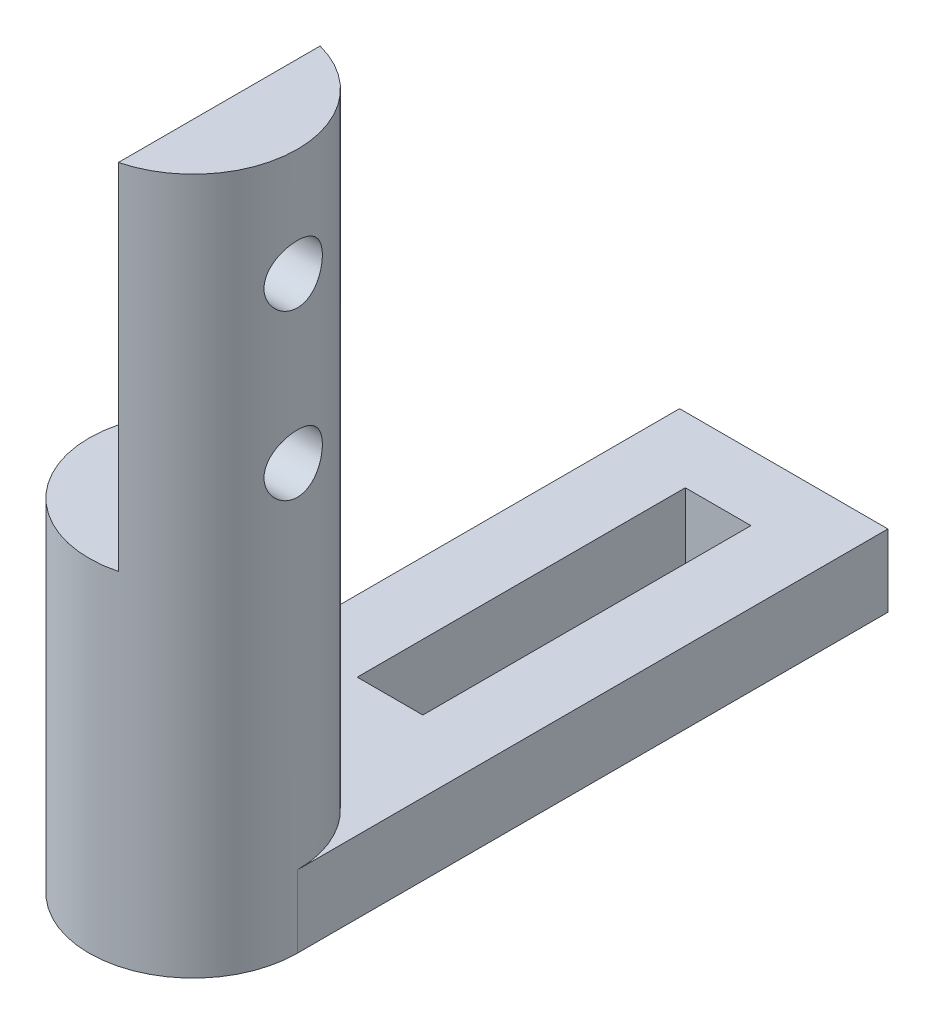
ISO-10303-21;
HEADER;
FILE_DESCRIPTION(('STEP AP214'),'2;1');
FILE_NAME('part.step','',(''),(''),'','','');
FILE_SCHEMA(('AUTOMOTIVE_DESIGN { 1 0 10303 214 1 1 1 1 }'));
ENDSEC;
DATA;
#1=APPLICATION_CONTEXT('core data for automotive mechanical design processes');
#2=APPLICATION_PROTOCOL_DEFINITION('international standard','automotive_design',2000,#1);
#3=PRODUCT_CONTEXT('',#1,'mechanical');
#4=PRODUCT('Part','Part','',(#3));
#5=PRODUCT_RELATED_PRODUCT_CATEGORY('part','',(#4));
#6=PRODUCT_DEFINITION_FORMATION('','',#4);
#7=PRODUCT_DEFINITION_CONTEXT('part definition',#1,'design');
#8=PRODUCT_DEFINITION('design','',#6,#7);
#9=PRODUCT_DEFINITION_SHAPE('','',#8);
#10=(LENGTH_UNIT() NAMED_UNIT(*) SI_UNIT(.MILLI.,.METRE.));
#11=(NAMED_UNIT(*) PLANE_ANGLE_UNIT() SI_UNIT($,.RADIAN.));
#12=(NAMED_UNIT(*) SI_UNIT($,.STERADIAN.) SOLID_ANGLE_UNIT());
#13=UNCERTAINTY_MEASURE_WITH_UNIT(LENGTH_MEASURE(1.E-05),#10,'distance_accuracy_value','');
#14=(GEOMETRIC_REPRESENTATION_CONTEXT(3) GLOBAL_UNCERTAINTY_ASSIGNED_CONTEXT((#13)) GLOBAL_UNIT_ASSIGNED_CONTEXT((#10,
#11,#12)) REPRESENTATION_CONTEXT('',''));
#15=CARTESIAN_POINT('',(0.,0.,0.));
#16=DIRECTION('',(0.,0.,1.));
#17=DIRECTION('',(1.,0.,0.));
#18=AXIS2_PLACEMENT_3D('',#15,#16,#17);
#19=CARTESIAN_POINT('',(0.,57.15,0.));
#20=DIRECTION('',(0.,-1.,0.));
#21=DIRECTION('',(0.,0.,-1.));
#22=AXIS2_PLACEMENT_3D('',#19,#20,#21);
#23=CYLINDRICAL_SURFACE('',#22,3.175);
#24=DIRECTION('',(0.,1.,0.));
#25=VECTOR('',#24,1.);
#26=CARTESIAN_POINT('',(3.175,35.93,0.));
#27=LINE('',#26,#25);
#28=CARTESIAN_POINT('',(3.175,35.93,0.));
#29=VERTEX_POINT('',#28);
#30=CARTESIAN_POINT('',(3.175,38.13,0.));
#31=VERTEX_POINT('',#30);
#32=EDGE_CURVE('E62',#29,#31,#27,.T.);
#33=ORIENTED_EDGE('',*,*,#32,.T.);
#34=CARTESIAN_POINT('',(0.,38.13,0.));
#35=DIRECTION('',(0.,-1.,0.));
#36=DIRECTION('',(0.,0.,-1.));
#37=AXIS2_PLACEMENT_3D('',#34,#35,#36);
#38=CIRCLE('',#37,3.175);
#39=CARTESIAN_POINT('',(-3.175,38.13,0.));
#40=VERTEX_POINT('',#39);
#41=EDGE_CURVE('E11',#40,#31,#38,.T.);
#42=ORIENTED_EDGE('',*,*,#41,.F.);
#43=DIRECTION('',(0.,1.,0.));
#44=VECTOR('',#43,1.);
#45=CARTESIAN_POINT('',(-3.175,35.93,0.));
#46=LINE('',#45,#44);
#47=CARTESIAN_POINT('',(-3.175,35.93,0.));
#48=VERTEX_POINT('',#47);
#49=EDGE_CURVE('E55',#48,#40,#46,.T.);
#50=ORIENTED_EDGE('',*,*,#49,.F.);
#51=CARTESIAN_POINT('',(0.,35.93,0.));
#52=DIRECTION('',(0.,-1.,0.));
#53=DIRECTION('',(0.,0.,-1.));
#54=AXIS2_PLACEMENT_3D('',#51,#52,#53);
#55=CIRCLE('',#54,3.175);
#56=EDGE_CURVE('E171',#29,#48,#55,.T.);
#57=ORIENTED_EDGE('',*,*,#56,.F.);
#58=EDGE_LOOP('',(#33,#42,#50,#57));
#59=FACE_BOUND('',#58,.T.);
#60=CARTESIAN_POINT('',(3.048,53.855,0.889));
#61=CARTESIAN_POINT('',(3.04800074144579,53.9038733654637,0.888999022704975));
#62=CARTESIAN_POINT('',(3.0491883536904,53.9527567364062,0.884956005900081));
#63=CARTESIAN_POINT('',(3.05379446473852,54.0491049848988,0.86892561421158));
#64=CARTESIAN_POINT('',(3.05721393512249,54.096569235257,0.856934779420127));
#65=CARTESIAN_POINT('',(3.06586679255467,54.1886712317961,0.825439260264912));
#66=CARTESIAN_POINT('',(3.07109744934927,54.2333131134177,0.80594588062788));
#67=CARTESIAN_POINT('',(3.08277975485952,54.3187015211283,0.76003475636559));
#68=CARTESIAN_POINT('',(3.0892315334209,54.3594476322734,0.733616275257371));
#69=CARTESIAN_POINT('',(3.10282851808416,54.4370111447716,0.673825649223518));
#70=CARTESIAN_POINT('',(3.10998700385331,54.4737052421074,0.640296533333315));
#71=CARTESIAN_POINT('',(3.12407666925912,54.5410299343499,0.567573542210274));
#72=CARTESIAN_POINT('',(3.13100782316884,54.5716598449399,0.528379028524614));
#73=CARTESIAN_POINT('',(3.14401109305889,54.6265090608122,0.444574237503614));
#74=CARTESIAN_POINT('',(3.15006572408435,54.6506045660182,0.399879985189847));
#75=CARTESIAN_POINT('',(3.16048064645674,54.6908915244847,0.306876342799879));
#76=CARTESIAN_POINT('',(3.16484125401579,54.7070844530113,0.258567629420829));
#77=CARTESIAN_POINT('',(3.17128288506878,54.7307040631926,0.160994613397916));
#78=CARTESIAN_POINT('',(3.17341843142117,54.7383407786606,0.111784817223569));
#79=CARTESIAN_POINT('',(3.17536048694193,54.7452932743307,0.0127392624770647));
#80=CARTESIAN_POINT('',(3.17516742430905,54.7446105843552,-0.0370963793271483));
#81=CARTESIAN_POINT('',(3.17251342098985,54.735088882728,-0.134512605209552));
#82=CARTESIAN_POINT('',(3.17011563326432,54.7264769888744,-0.18211737468884));
#83=CARTESIAN_POINT('',(3.16339697389186,54.7017098300263,-0.275176901920622));
#84=CARTESIAN_POINT('',(3.15907598732543,54.6855541142527,-0.320631531013265));
#85=CARTESIAN_POINT('',(3.14890524255914,54.6459918167282,-0.408664749201556));
#86=CARTESIAN_POINT('',(3.14303970776309,54.6225099164607,-0.451207592285719));
#87=CARTESIAN_POINT('',(3.1304081222126,54.5690202636264,-0.531824617738516));
#88=CARTESIAN_POINT('',(3.12364188079185,54.5390111284853,-0.569897850736414));
#89=CARTESIAN_POINT('',(3.10966917671264,54.472123673229,-0.64185082699832));
#90=CARTESIAN_POINT('',(3.1024555637627,54.4350476993962,-0.675545670788159));
#91=CARTESIAN_POINT('',(3.08860471608588,54.3556980560687,-0.736287397269033));
#92=CARTESIAN_POINT('',(3.0819675243892,54.3134239991019,-0.763333783924004));
#93=CARTESIAN_POINT('',(3.06999005425627,54.2244444097016,-0.810171227980408));
#94=CARTESIAN_POINT('',(3.06465973815351,54.1777083945776,-0.829907105431936));
#95=CARTESIAN_POINT('',(3.05602075215966,54.0813941993218,-0.861178446006272));
#96=CARTESIAN_POINT('',(3.05271152110212,54.0318168122998,-0.872716185537043));
#97=CARTESIAN_POINT('',(3.04861036820764,53.9329684098257,-0.88693469934459));
#98=CARTESIAN_POINT('',(3.04773950623862,53.8837405964397,-0.889893331949965));
#99=CARTESIAN_POINT('',(3.04839680667467,53.7854926125504,-0.887639246904802));
#100=CARTESIAN_POINT('',(3.04992468355344,53.7364724180303,-0.882427501789495));
#101=CARTESIAN_POINT('',(3.0551305705055,53.6411353392666,-0.864226581903412));
#102=CARTESIAN_POINT('',(3.05876110757367,53.5947828515508,-0.851408976918569));
#103=CARTESIAN_POINT('',(3.06771577424975,53.5048869252364,-0.818555399608298));
#104=CARTESIAN_POINT('',(3.07304014129867,53.4613438814956,-0.798518415218364));
#105=CARTESIAN_POINT('',(3.08494108557681,53.3771528913416,-0.751245255343617));
#106=CARTESIAN_POINT('',(3.09154455793357,53.336599053057,-0.723848410491956));
#107=CARTESIAN_POINT('',(3.10519857691837,53.2605624680078,-0.662829100750051));
#108=CARTESIAN_POINT('',(3.11224921630329,53.2250807783703,-0.629205341400976));
#109=CARTESIAN_POINT('',(3.12627846255595,53.1590184791837,-0.555393175540642));
#110=CARTESIAN_POINT('',(3.13324740753382,53.1286329109128,-0.515027982119803));
#111=CARTESIAN_POINT('',(3.14609634169483,53.0750663487539,-0.429610615302622));
#112=CARTESIAN_POINT('',(3.15197638840411,53.0518849742268,-0.384558689701356));
#113=CARTESIAN_POINT('',(3.16194727289417,53.013604157135,-0.291361546194213));
#114=CARTESIAN_POINT('',(3.16605159772319,52.9984435908583,-0.243242948857278));
#115=CARTESIAN_POINT('',(3.17206811720327,52.9764640428509,-0.145007590278837));
#116=CARTESIAN_POINT('',(3.17398085158866,52.969643007273,-0.0948913241610756));
#117=CARTESIAN_POINT('',(3.17537031148508,52.9646756462352,0.00410257465857598));
#118=CARTESIAN_POINT('',(3.17492700643421,52.9662445579541,0.0529649880377303));
#119=CARTESIAN_POINT('',(3.17183800207679,52.9773438045136,0.149702046305526));
#120=CARTESIAN_POINT('',(3.1691924010422,52.9868737841116,0.197576735171222));
#121=CARTESIAN_POINT('',(3.16201473209881,53.0134573009097,0.290599820702145));
#122=CARTESIAN_POINT('',(3.15749847230393,53.0304478626725,0.335767515655421));
#123=CARTESIAN_POINT('',(3.14704937045711,53.071414238752,0.422636400107661));
#124=CARTESIAN_POINT('',(3.1411163150138,53.0953911054345,0.464337066141583));
#125=CARTESIAN_POINT('',(3.12825099335539,53.1504535292501,0.544392318898718));
#126=CARTESIAN_POINT('',(3.12129485795685,53.1817240427912,0.582615836411658));
#127=CARTESIAN_POINT('',(3.10725567651361,53.2501422555483,0.653368888845674));
#128=CARTESIAN_POINT('',(3.10017259641915,53.287291553173,0.68589687010055));
#129=CARTESIAN_POINT('',(3.08647631222338,53.3675262150993,0.745143293434857));
#130=CARTESIAN_POINT('',(3.07987922601124,53.4107364855654,0.771696671947966));
#131=CARTESIAN_POINT('',(3.06814009982461,53.5011873096254,0.817126280627679));
#132=CARTESIAN_POINT('',(3.06299720300363,53.5484254684335,0.836007034585141));
#133=CARTESIAN_POINT('',(3.05538486849526,53.638669406351,0.863376907077115));
#134=CARTESIAN_POINT('',(3.05263934900825,53.6813225211211,0.872961556556881));
#135=CARTESIAN_POINT('',(3.0489467122479,53.7676478578347,0.885773084342433));
#136=CARTESIAN_POINT('',(3.04799933734046,53.8113199328759,0.889000873447365));
#137=CARTESIAN_POINT('',(3.048,53.855,0.889));
#138=B_SPLINE_CURVE_WITH_KNOTS('',3,(#60,#61,#62,#63,#64,#65,#66,#67,#68,#69,#70,#71,#72,#73,
#74,#75,#76,#77,#78,#79,#80,#81,#82,#83,#84,#85,#86,#87,#88,#89,#90,#91,#92,#93,#94,#95,#96,#97,
#98,#99,#100,#101,#102,#103,#104,#105,#106,#107,#108,#109,#110,#111,#112,#113,#114,#115,#116,
#117,#118,#119,#120,#121,#122,#123,#124,#125,#126,#127,#128,#129,#130,#131,#132,#133,#134,#135,
#136,#137),.UNSPECIFIED.,.T.,.F.,(4,2,2,2,2,2,2,2,2,2,2,2,2,2,2,2,2,2,2,2,2,2,2,2,2,2,2,2,2,2,2,
2,2,2,2,2,2,2,4),(0.,0.146459287401067,0.292982374544872,0.439285541729908,0.585604274540455,
0.735571650820734,0.885555940626635,1.03820968127062,1.19083491334784,1.33962536162133,
1.48838844982117,1.63301874819051,1.77765769001139,1.92383555425299,2.07004441154515,
2.22118784811517,2.37234255795564,2.52461599929672,2.6768471417545,2.82408956362908,
2.97131446029551,3.1153382232534,3.25938218435847,3.40687004300796,3.55438859610561,
3.70666622842306,3.85893581366485,4.01002765448382,4.1610822771287,4.30704320227681,
4.45299761463259,4.59774301104066,4.7425102221143,4.89144959773006,5.04042953893497,
5.19312385990269,5.3457280209917,5.47664325964223,5.60753973963556),.UNSPECIFIED.);
#139=CARTESIAN_POINT('',(3.048,53.855,0.889));
#140=VERTEX_POINT('',#139);
#141=EDGE_CURVE('E222',#140,#140,#138,.T.);
#142=ORIENTED_EDGE('',*,*,#141,.T.);
#143=EDGE_LOOP('',(#142));
#144=FACE_BOUND('',#143,.T.);
#145=CARTESIAN_POINT('',(3.048,48.855,0.889));
#146=CARTESIAN_POINT('',(3.04800074144579,48.9038733654637,0.888999022704976));
#147=CARTESIAN_POINT('',(3.0491883536904,48.9527567364062,0.884956005900081));
#148=CARTESIAN_POINT('',(3.05379446473852,49.0491049848988,0.868925614211581));
#149=CARTESIAN_POINT('',(3.05721393512249,49.096569235257,0.856934779420127));
#150=CARTESIAN_POINT('',(3.06586679255467,49.1886712317961,0.825439260264913));
#151=CARTESIAN_POINT('',(3.07109744934927,49.2333131134177,0.80594588062788));
#152=CARTESIAN_POINT('',(3.08277975485952,49.3187015211283,0.760034756365591));
#153=CARTESIAN_POINT('',(3.0892315334209,49.3594476322734,0.733616275257372));
#154=CARTESIAN_POINT('',(3.10282851808416,49.4370111447716,0.673825649223519));
#155=CARTESIAN_POINT('',(3.10998700385331,49.4737052421073,0.640296533333315));
#156=CARTESIAN_POINT('',(3.12407666925912,49.5410299343499,0.567573542210273));
#157=CARTESIAN_POINT('',(3.13100782316884,49.5716598449399,0.528379028524615));
#158=CARTESIAN_POINT('',(3.14401109305889,49.6265090608122,0.444574237503616));
#159=CARTESIAN_POINT('',(3.15006572408435,49.6506045660182,0.399879985189847));
#160=CARTESIAN_POINT('',(3.16048064645674,49.6908915244846,0.306876342799879));
#161=CARTESIAN_POINT('',(3.16484125401579,49.7070844530113,0.25856762942083));
#162=CARTESIAN_POINT('',(3.17128288506878,49.7307040631926,0.160994613397917));
#163=CARTESIAN_POINT('',(3.17341843142117,49.7383407786606,0.111784817223569));
#164=CARTESIAN_POINT('',(3.17536048694193,49.7452932743306,0.0127392624770652));
#165=CARTESIAN_POINT('',(3.17516742430905,49.7446105843552,-0.0370963793271478));
#166=CARTESIAN_POINT('',(3.17251342098985,49.735088882728,-0.134512605209552));
#167=CARTESIAN_POINT('',(3.17011563326432,49.7264769888744,-0.182117374688842));
#168=CARTESIAN_POINT('',(3.16339697389186,49.7017098300263,-0.275176901920624));
#169=CARTESIAN_POINT('',(3.15907598732543,49.6855541142527,-0.320631531013265));
#170=CARTESIAN_POINT('',(3.14890524255914,49.6459918167282,-0.408664749201556));
#171=CARTESIAN_POINT('',(3.14303970776309,49.6225099164607,-0.451207592285721));
#172=CARTESIAN_POINT('',(3.1304081222126,49.5690202636264,-0.531824617738518));
#173=CARTESIAN_POINT('',(3.12364188079185,49.5390111284853,-0.569897850736415));
#174=CARTESIAN_POINT('',(3.10966917671264,49.472123673229,-0.641850826998317));
#175=CARTESIAN_POINT('',(3.1024555637627,49.4350476993962,-0.675545670788154));
#176=CARTESIAN_POINT('',(3.08860471608588,49.3556980560687,-0.736287397269028));
#177=CARTESIAN_POINT('',(3.0819675243892,49.3134239991019,-0.763333783924003));
#178=CARTESIAN_POINT('',(3.06999005425627,49.2244444097016,-0.810171227980407));
#179=CARTESIAN_POINT('',(3.06465973815351,49.1777083945775,-0.829907105431934));
#180=CARTESIAN_POINT('',(3.05602075215966,49.0813941993218,-0.86117844600627));
#181=CARTESIAN_POINT('',(3.05271152110212,49.0318168122998,-0.872716185537042));
#182=CARTESIAN_POINT('',(3.04861036820764,48.9329684098257,-0.88693469934459));
#183=CARTESIAN_POINT('',(3.04773950623862,48.8837405964397,-0.889893331949965));
#184=CARTESIAN_POINT('',(3.04839680667467,48.7854926125504,-0.887639246904802));
#185=CARTESIAN_POINT('',(3.04992468355344,48.7364724180303,-0.882427501789494));
#186=CARTESIAN_POINT('',(3.0551305705055,48.6411353392666,-0.864226581903411));
#187=CARTESIAN_POINT('',(3.05876110757367,48.5947828515507,-0.851408976918569));
#188=CARTESIAN_POINT('',(3.06771577424975,48.5048869252364,-0.818555399608297));
#189=CARTESIAN_POINT('',(3.07304014129867,48.4613438814956,-0.798518415218363));
#190=CARTESIAN_POINT('',(3.08494108557681,48.3771528913416,-0.751245255343617));
#191=CARTESIAN_POINT('',(3.09154455793357,48.336599053057,-0.723848410491955));
#192=CARTESIAN_POINT('',(3.10519857691837,48.2605624680078,-0.66282910075005));
#193=CARTESIAN_POINT('',(3.11224921630329,48.2250807783703,-0.629205341400975));
#194=CARTESIAN_POINT('',(3.12627846255595,48.1590184791837,-0.555393175540641));
#195=CARTESIAN_POINT('',(3.13324740753382,48.1286329109128,-0.515027982119802));
#196=CARTESIAN_POINT('',(3.14609634169483,48.0750663487539,-0.429610615302621));
#197=CARTESIAN_POINT('',(3.15197638840411,48.0518849742268,-0.384558689701355));
#198=CARTESIAN_POINT('',(3.16194727289417,48.013604157135,-0.291361546194213));
#199=CARTESIAN_POINT('',(3.16605159772319,47.9984435908583,-0.243242948857277));
#200=CARTESIAN_POINT('',(3.17206811720327,47.9764640428509,-0.145007590278837));
#201=CARTESIAN_POINT('',(3.17398085158866,47.969643007273,-0.094891324161075));
#202=CARTESIAN_POINT('',(3.17537031148508,47.9646756462352,0.00410257465857676));
#203=CARTESIAN_POINT('',(3.17492700643421,47.9662445579541,0.0529649880377312));
#204=CARTESIAN_POINT('',(3.17183800207679,47.9773438045136,0.149702046305527));
#205=CARTESIAN_POINT('',(3.1691924010422,47.9868737841116,0.197576735171222));
#206=CARTESIAN_POINT('',(3.16201473209881,48.0134573009097,0.290599820702147));
#207=CARTESIAN_POINT('',(3.15749847230393,48.0304478626725,0.335767515655424));
#208=CARTESIAN_POINT('',(3.14704937045711,48.071414238752,0.422636400107665));
#209=CARTESIAN_POINT('',(3.1411163150138,48.0953911054345,0.464337066141584));
#210=CARTESIAN_POINT('',(3.12825099335539,48.1504535292501,0.544392318898719));
#211=CARTESIAN_POINT('',(3.12129485795685,48.1817240427912,0.582615836411659));
#212=CARTESIAN_POINT('',(3.10725567651361,48.2501422555483,0.653368888845675));
#213=CARTESIAN_POINT('',(3.10017259641915,48.287291553173,0.68589687010055));
#214=CARTESIAN_POINT('',(3.08647631222338,48.3675262150993,0.745143293434857));
#215=CARTESIAN_POINT('',(3.07987922601124,48.4107364855654,0.771696671947967));
#216=CARTESIAN_POINT('',(3.0681400998246,48.5011873096253,0.817126280627679));
#217=CARTESIAN_POINT('',(3.06299720300363,48.5484254684335,0.836007034585142));
#218=CARTESIAN_POINT('',(3.05538486849526,48.638669406351,0.863376907077116));
#219=CARTESIAN_POINT('',(3.05263934900825,48.6813225211211,0.872961556556881));
#220=CARTESIAN_POINT('',(3.0489467122479,48.7676478578347,0.885773084342434));
#221=CARTESIAN_POINT('',(3.04799933734046,48.8113199328759,0.889000873447365));
#222=CARTESIAN_POINT('',(3.048,48.855,0.889));
#223=B_SPLINE_CURVE_WITH_KNOTS('',3,(#145,#146,#147,#148,#149,#150,#151,#152,#153,#154,#155,
#156,#157,#158,#159,#160,#161,#162,#163,#164,#165,#166,#167,#168,#169,#170,#171,#172,#173,#174,
#175,#176,#177,#178,#179,#180,#181,#182,#183,#184,#185,#186,#187,#188,#189,#190,#191,#192,#193,
#194,#195,#196,#197,#198,#199,#200,#201,#202,#203,#204,#205,#206,#207,#208,#209,#210,#211,#212,
#213,#214,#215,#216,#217,#218,#219,#220,#221,#222),.UNSPECIFIED.,.T.,.F.,(4,2,2,2,2,2,2,2,2,2,2,
2,2,2,2,2,2,2,2,2,2,2,2,2,2,2,2,2,2,2,2,2,2,2,2,2,2,2,4),(0.,0.146459287401067,
0.292982374544872,0.439285541729908,0.585604274540455,0.735571650820729,0.885555940626634,
1.03820968127062,1.19083491334784,1.33962536162133,1.48838844982117,1.63301874819052,
1.77765769001139,1.923835554253,2.07004441154515,2.22118784811516,2.37234255795564,
2.52461599929671,2.6768471417545,2.82408956362907,2.97131446029551,3.1153382232534,
3.25938218435847,3.40687004300796,3.55438859610561,3.70666622842306,3.85893581366485,
4.01002765448382,4.1610822771287,4.30704320227681,4.45299761463259,4.59774301104066,
4.74251022211431,4.89144959773006,5.04042953893497,5.19312385990269,5.3457280209917,
5.47664325964223,5.60753973963556),.UNSPECIFIED.);
#224=CARTESIAN_POINT('',(3.048,48.855,0.889));
#225=VERTEX_POINT('',#224);
#226=EDGE_CURVE('E211',#225,#225,#223,.T.);
#227=ORIENTED_EDGE('',*,*,#226,.T.);
#228=EDGE_LOOP('',(#227));
#229=FACE_BOUND('',#228,.T.);
#230=CARTESIAN_POINT('',(0.,57.15,0.));
#231=DIRECTION('',(0.,1.,0.));
#232=DIRECTION('',(0.,0.,1.));
#233=AXIS2_PLACEMENT_3D('',#230,#231,#232);
#234=CIRCLE('',#233,3.175);
#235=CARTESIAN_POINT('',(0.794,57.15,3.07411597048648));
#236=VERTEX_POINT('',#235);
#237=CARTESIAN_POINT('',(0.794,57.15,-3.07411597048648));
#238=VERTEX_POINT('',#237);
#239=EDGE_CURVE('E253',#236,#238,#234,.T.);
#240=ORIENTED_EDGE('',*,*,#239,.F.);
#241=DIRECTION('',(0.,-1.,0.));
#242=VECTOR('',#241,1.);
#243=CARTESIAN_POINT('',(0.794,57.15,3.07411597048648));
#244=LINE('',#243,#242);
#245=CARTESIAN_POINT('',(0.794,46.355,3.07411597048648));
#246=VERTEX_POINT('',#245);
#247=EDGE_CURVE('E261',#236,#246,#244,.T.);
#248=ORIENTED_EDGE('',*,*,#247,.T.);
#249=CARTESIAN_POINT('',(0.,46.355,0.));
#250=DIRECTION('',(0.,-1.,0.));
#251=DIRECTION('',(0.,0.,-1.));
#252=AXIS2_PLACEMENT_3D('',#249,#250,#251);
#253=CIRCLE('',#252,3.175);
#254=CARTESIAN_POINT('',(0.794,46.355,-3.07411597048648));
#255=VERTEX_POINT('',#254);
#256=EDGE_CURVE('E48',#246,#255,#253,.T.);
#257=ORIENTED_EDGE('',*,*,#256,.T.);
#258=DIRECTION('',(0.,-1.,0.));
#259=VECTOR('',#258,1.);
#260=CARTESIAN_POINT('',(0.794,57.15,-3.07411597048648));
#261=LINE('',#260,#259);
#262=EDGE_CURVE('E262',#255,#238,#261,.F.);
#263=ORIENTED_EDGE('',*,*,#262,.T.);
#264=EDGE_LOOP('',(#240,#248,#257,#263));
#265=FACE_BOUND('',#264,.T.);
#266=ADVANCED_FACE('F39',(#59,#144,#229,#265),#23,.T.);
#267=CARTESIAN_POINT('',(0.,57.15,0.));
#268=DIRECTION('',(0.,1.,0.));
#269=DIRECTION('',(0.,0.,1.));
#270=AXIS2_PLACEMENT_3D('',#267,#268,#269);
#271=PLANE('',#270);
#272=DIRECTION('',(0.,0.,-1.));
#273=VECTOR('',#272,1.);
#274=CARTESIAN_POINT('',(0.794,57.15,0.));
#275=LINE('',#274,#273);
#276=EDGE_CURVE('E251',#236,#238,#275,.T.);
#277=ORIENTED_EDGE('',*,*,#276,.F.);
#278=ORIENTED_EDGE('',*,*,#239,.T.);
#279=EDGE_LOOP('',(#277,#278));
#280=FACE_BOUND('',#279,.T.);
#281=ADVANCED_FACE('F240',(#280),#271,.T.);
#282=CARTESIAN_POINT('',(0.,46.355,0.));
#283=DIRECTION('',(0.,-1.,0.));
#284=DIRECTION('',(0.,0.,-1.));
#285=AXIS2_PLACEMENT_3D('',#282,#283,#284);
#286=PLANE('',#285);
#287=ORIENTED_EDGE('',*,*,#256,.F.);
#288=DIRECTION('',(0.,0.,-1.));
#289=VECTOR('',#288,1.);
#290=CARTESIAN_POINT('',(0.794,46.355,-3.175));
#291=LINE('',#290,#289);
#292=EDGE_CURVE('E271',#246,#255,#291,.T.);
#293=ORIENTED_EDGE('',*,*,#292,.T.);
#294=EDGE_LOOP('',(#287,#293));
#295=FACE_BOUND('',#294,.T.);
#296=ADVANCED_FACE('F237',(#295),#286,.F.);
#297=CARTESIAN_POINT('',(0.794,46.355,-3.175));
#298=DIRECTION('',(1.,0.,0.));
#299=DIRECTION('',(0.,0.,-1.));
#300=AXIS2_PLACEMENT_3D('',#297,#298,#299);
#301=PLANE('',#300);
#302=CARTESIAN_POINT('',(0.794,53.855,0.));
#303=DIRECTION('',(-1.,0.,0.));
#304=DIRECTION('',(0.,0.,1.));
#305=AXIS2_PLACEMENT_3D('',#302,#303,#304);
#306=CIRCLE('',#305,0.888999999999999);
#307=CARTESIAN_POINT('',(0.794,53.855,0.889));
#308=VERTEX_POINT('',#307);
#309=EDGE_CURVE('E207',#308,#308,#306,.T.);
#310=ORIENTED_EDGE('',*,*,#309,.F.);
#311=EDGE_LOOP('',(#310));
#312=FACE_BOUND('',#311,.T.);
#313=CARTESIAN_POINT('',(0.794,48.855,0.));
#314=DIRECTION('',(-1.,0.,0.));
#315=DIRECTION('',(0.,0.,1.));
#316=AXIS2_PLACEMENT_3D('',#313,#314,#315);
#317=CIRCLE('',#316,0.888999999999999);
#318=CARTESIAN_POINT('',(0.794,48.855,0.889));
#319=VERTEX_POINT('',#318);
#320=EDGE_CURVE('E206',#319,#319,#317,.T.);
#321=ORIENTED_EDGE('',*,*,#320,.F.);
#322=EDGE_LOOP('',(#321));
#323=FACE_BOUND('',#322,.T.);
#324=ORIENTED_EDGE('',*,*,#276,.T.);
#325=ORIENTED_EDGE('',*,*,#262,.F.);
#326=ORIENTED_EDGE('',*,*,#292,.F.);
#327=ORIENTED_EDGE('',*,*,#247,.F.);
#328=EDGE_LOOP('',(#324,#325,#326,#327));
#329=FACE_BOUND('',#328,.T.);
#330=ADVANCED_FACE('F233',(#312,#323,#329),#301,.F.);
#331=CARTESIAN_POINT('',(11.589,48.855,0.));
#332=DIRECTION('',(-1.,0.,0.));
#333=DIRECTION('',(0.,0.,1.));
#334=AXIS2_PLACEMENT_3D('',#331,#332,#333);
#335=CYLINDRICAL_SURFACE('',#334,0.888999999999999);
#336=ORIENTED_EDGE('',*,*,#320,.T.);
#337=EDGE_LOOP('',(#336));
#338=FACE_BOUND('',#337,.T.);
#339=ORIENTED_EDGE('',*,*,#226,.F.);
#340=EDGE_LOOP('',(#339));
#341=FACE_BOUND('',#340,.T.);
#342=ADVANCED_FACE('F228',(#338,#341),#335,.F.);
#343=CARTESIAN_POINT('',(11.589,53.855,0.));
#344=DIRECTION('',(-1.,0.,0.));
#345=DIRECTION('',(0.,0.,1.));
#346=AXIS2_PLACEMENT_3D('',#343,#344,#345);
#347=CYLINDRICAL_SURFACE('',#346,0.888999999999999);
#348=ORIENTED_EDGE('',*,*,#309,.T.);
#349=EDGE_LOOP('',(#348));
#350=FACE_BOUND('',#349,.T.);
#351=ORIENTED_EDGE('',*,*,#141,.F.);
#352=EDGE_LOOP('',(#351));
#353=FACE_BOUND('',#352,.T.);
#354=ADVANCED_FACE('F232',(#350,#353),#347,.F.);
#355=CARTESIAN_POINT('',(0.,35.93,0.));
#356=DIRECTION('',(0.,-1.,0.));
#357=DIRECTION('',(0.,0.,-1.));
#358=AXIS2_PLACEMENT_3D('',#355,#356,#357);
#359=PLANE('',#358);
#360=ORIENTED_EDGE('',*,*,#56,.T.);
#361=DIRECTION('',(0.,0.,-1.));
#362=VECTOR('',#361,1.);
#363=CARTESIAN_POINT('',(-3.175,35.93,-18.));
#364=LINE('',#363,#362);
#365=CARTESIAN_POINT('',(-3.175,35.93,-18.));
#366=VERTEX_POINT('',#365);
#367=EDGE_CURVE('E175',#48,#366,#364,.T.);
#368=ORIENTED_EDGE('',*,*,#367,.T.);
#369=DIRECTION('',(1.,0.,0.));
#370=VECTOR('',#369,1.);
#371=CARTESIAN_POINT('',(3.175,35.93,-18.));
#372=LINE('',#371,#370);
#373=CARTESIAN_POINT('',(3.175,35.93,-18.));
#374=VERTEX_POINT('',#373);
#375=EDGE_CURVE('E179',#366,#374,#372,.T.);
#376=ORIENTED_EDGE('',*,*,#375,.T.);
#377=DIRECTION('',(0.,0.,1.));
#378=VECTOR('',#377,1.);
#379=CARTESIAN_POINT('',(3.175,35.93,0.));
#380=LINE('',#379,#378);
#381=EDGE_CURVE('E182',#374,#29,#380,.T.);
#382=ORIENTED_EDGE('',*,*,#381,.T.);
#383=EDGE_LOOP('',(#360,#368,#376,#382));
#384=FACE_BOUND('',#383,.T.);
#385=DIRECTION('',(0.,0.,-1.));
#386=VECTOR('',#385,1.);
#387=CARTESIAN_POINT('',(-1.,35.93,-6.));
#388=LINE('',#387,#386);
#389=CARTESIAN_POINT('',(-1.,35.93,-6.));
#390=VERTEX_POINT('',#389);
#391=CARTESIAN_POINT('',(-1.,35.93,-16.));
#392=VERTEX_POINT('',#391);
#393=EDGE_CURVE('E128',#390,#392,#388,.T.);
#394=ORIENTED_EDGE('',*,*,#393,.F.);
#395=DIRECTION('',(-1.,0.,0.));
#396=VECTOR('',#395,1.);
#397=CARTESIAN_POINT('',(1.,35.93,-6.));
#398=LINE('',#397,#396);
#399=CARTESIAN_POINT('',(1.,35.93,-6.));
#400=VERTEX_POINT('',#399);
#401=EDGE_CURVE('E117',#400,#390,#398,.T.);
#402=ORIENTED_EDGE('',*,*,#401,.F.);
#403=DIRECTION('',(0.,0.,1.));
#404=VECTOR('',#403,1.);
#405=CARTESIAN_POINT('',(1.,35.93,-16.));
#406=LINE('',#405,#404);
#407=CARTESIAN_POINT('',(1.,35.93,-16.));
#408=VERTEX_POINT('',#407);
#409=EDGE_CURVE('E147',#408,#400,#406,.T.);
#410=ORIENTED_EDGE('',*,*,#409,.F.);
#411=DIRECTION('',(1.,0.,0.));
#412=VECTOR('',#411,1.);
#413=CARTESIAN_POINT('',(-1.,35.93,-16.));
#414=LINE('',#413,#412);
#415=EDGE_CURVE('E143',#392,#408,#414,.T.);
#416=ORIENTED_EDGE('',*,*,#415,.F.);
#417=EDGE_LOOP('',(#394,#402,#410,#416));
#418=FACE_BOUND('',#417,.T.);
#419=ADVANCED_FACE('F141',(#384,#418),#359,.T.);
#420=CARTESIAN_POINT('',(0.,38.13,0.));
#421=DIRECTION('',(0.,-1.,0.));
#422=DIRECTION('',(0.,0.,-1.));
#423=AXIS2_PLACEMENT_3D('',#420,#421,#422);
#424=PLANE('',#423);
#425=DIRECTION('',(0.,0.,-1.));
#426=VECTOR('',#425,1.);
#427=CARTESIAN_POINT('',(-3.175,38.13,-18.));
#428=LINE('',#427,#426);
#429=CARTESIAN_POINT('',(-3.175,38.13,-18.));
#430=VERTEX_POINT('',#429);
#431=EDGE_CURVE('E137',#40,#430,#428,.T.);
#432=ORIENTED_EDGE('',*,*,#431,.F.);
#433=ORIENTED_EDGE('',*,*,#41,.T.);
#434=DIRECTION('',(0.,0.,1.));
#435=VECTOR('',#434,1.);
#436=CARTESIAN_POINT('',(3.175,38.13,0.));
#437=LINE('',#436,#435);
#438=CARTESIAN_POINT('',(3.175,38.13,-18.));
#439=VERTEX_POINT('',#438);
#440=EDGE_CURVE('E176',#439,#31,#437,.T.);
#441=ORIENTED_EDGE('',*,*,#440,.F.);
#442=DIRECTION('',(1.,0.,0.));
#443=VECTOR('',#442,1.);
#444=CARTESIAN_POINT('',(3.175,38.13,-18.));
#445=LINE('',#444,#443);
#446=EDGE_CURVE('E188',#430,#439,#445,.T.);
#447=ORIENTED_EDGE('',*,*,#446,.F.);
#448=EDGE_LOOP('',(#432,#433,#441,#447));
#449=FACE_BOUND('',#448,.T.);
#450=DIRECTION('',(-1.,0.,0.));
#451=VECTOR('',#450,1.);
#452=CARTESIAN_POINT('',(1.,38.13,-6.));
#453=LINE('',#452,#451);
#454=CARTESIAN_POINT('',(1.,38.13,-6.));
#455=VERTEX_POINT('',#454);
#456=CARTESIAN_POINT('',(-1.,38.13,-6.));
#457=VERTEX_POINT('',#456);
#458=EDGE_CURVE('E152',#455,#457,#453,.T.);
#459=ORIENTED_EDGE('',*,*,#458,.T.);
#460=DIRECTION('',(0.,0.,-1.));
#461=VECTOR('',#460,1.);
#462=CARTESIAN_POINT('',(-1.,38.13,-6.));
#463=LINE('',#462,#461);
#464=CARTESIAN_POINT('',(-1.,38.13,-16.));
#465=VERTEX_POINT('',#464);
#466=EDGE_CURVE('E135',#457,#465,#463,.T.);
#467=ORIENTED_EDGE('',*,*,#466,.T.);
#468=DIRECTION('',(1.,0.,0.));
#469=VECTOR('',#468,1.);
#470=CARTESIAN_POINT('',(-1.,38.13,-16.));
#471=LINE('',#470,#469);
#472=CARTESIAN_POINT('',(1.,38.13,-16.));
#473=VERTEX_POINT('',#472);
#474=EDGE_CURVE('E157',#465,#473,#471,.T.);
#475=ORIENTED_EDGE('',*,*,#474,.T.);
#476=DIRECTION('',(0.,0.,1.));
#477=VECTOR('',#476,1.);
#478=CARTESIAN_POINT('',(1.,38.13,-16.));
#479=LINE('',#478,#477);
#480=EDGE_CURVE('E129',#473,#455,#479,.T.);
#481=ORIENTED_EDGE('',*,*,#480,.T.);
#482=EDGE_LOOP('',(#459,#467,#475,#481));
#483=FACE_BOUND('',#482,.T.);
#484=ADVANCED_FACE('F285',(#449,#483),#424,.F.);
#485=CARTESIAN_POINT('',(-3.175,35.93,-18.));
#486=DIRECTION('',(1.,0.,0.));
#487=DIRECTION('',(0.,0.,-1.));
#488=AXIS2_PLACEMENT_3D('',#485,#486,#487);
#489=PLANE('',#488);
#490=ORIENTED_EDGE('',*,*,#431,.T.);
#491=DIRECTION('',(0.,1.,0.));
#492=VECTOR('',#491,1.);
#493=CARTESIAN_POINT('',(-3.175,35.93,-18.));
#494=LINE('',#493,#492);
#495=EDGE_CURVE('E200',#366,#430,#494,.T.);
#496=ORIENTED_EDGE('',*,*,#495,.F.);
#497=ORIENTED_EDGE('',*,*,#367,.F.);
#498=ORIENTED_EDGE('',*,*,#49,.T.);
#499=EDGE_LOOP('',(#490,#496,#497,#498));
#500=FACE_BOUND('',#499,.T.);
#501=ADVANCED_FACE('F296',(#500),#489,.F.);
#502=CARTESIAN_POINT('',(3.175,35.93,-18.));
#503=DIRECTION('',(0.,0.,1.));
#504=DIRECTION('',(1.,0.,0.));
#505=AXIS2_PLACEMENT_3D('',#502,#503,#504);
#506=PLANE('',#505);
#507=ORIENTED_EDGE('',*,*,#446,.T.);
#508=DIRECTION('',(0.,1.,0.));
#509=VECTOR('',#508,1.);
#510=CARTESIAN_POINT('',(3.175,35.93,-18.));
#511=LINE('',#510,#509);
#512=EDGE_CURVE('E196',#374,#439,#511,.T.);
#513=ORIENTED_EDGE('',*,*,#512,.F.);
#514=ORIENTED_EDGE('',*,*,#375,.F.);
#515=ORIENTED_EDGE('',*,*,#495,.T.);
#516=EDGE_LOOP('',(#507,#513,#514,#515));
#517=FACE_BOUND('',#516,.T.);
#518=ADVANCED_FACE('F305',(#517),#506,.F.);
#519=CARTESIAN_POINT('',(3.175,35.93,0.));
#520=DIRECTION('',(-1.,0.,0.));
#521=DIRECTION('',(0.,0.,1.));
#522=AXIS2_PLACEMENT_3D('',#519,#520,#521);
#523=PLANE('',#522);
#524=ORIENTED_EDGE('',*,*,#440,.T.);
#525=ORIENTED_EDGE('',*,*,#32,.F.);
#526=ORIENTED_EDGE('',*,*,#381,.F.);
#527=ORIENTED_EDGE('',*,*,#512,.T.);
#528=EDGE_LOOP('',(#524,#525,#526,#527));
#529=FACE_BOUND('',#528,.T.);
#530=ADVANCED_FACE('F302',(#529),#523,.F.);
#531=CARTESIAN_POINT('',(1.,35.93,-6.));
#532=DIRECTION('',(0.,0.,-1.));
#533=DIRECTION('',(-1.,0.,0.));
#534=AXIS2_PLACEMENT_3D('',#531,#532,#533);
#535=PLANE('',#534);
#536=ORIENTED_EDGE('',*,*,#458,.F.);
#537=DIRECTION('',(0.,1.,0.));
#538=VECTOR('',#537,1.);
#539=CARTESIAN_POINT('',(1.,35.93,-6.));
#540=LINE('',#539,#538);
#541=EDGE_CURVE('E123',#400,#455,#540,.T.);
#542=ORIENTED_EDGE('',*,*,#541,.F.);
#543=ORIENTED_EDGE('',*,*,#401,.T.);
#544=DIRECTION('',(0.,1.,0.));
#545=VECTOR('',#544,1.);
#546=CARTESIAN_POINT('',(-1.,35.93,-6.));
#547=LINE('',#546,#545);
#548=EDGE_CURVE('E120',#390,#457,#547,.T.);
#549=ORIENTED_EDGE('',*,*,#548,.T.);
#550=EDGE_LOOP('',(#536,#542,#543,#549));
#551=FACE_BOUND('',#550,.T.);
#552=ADVANCED_FACE('F119',(#551),#535,.T.);
#553=CARTESIAN_POINT('',(-1.,35.93,-6.));
#554=DIRECTION('',(1.,0.,0.));
#555=DIRECTION('',(0.,0.,-1.));
#556=AXIS2_PLACEMENT_3D('',#553,#554,#555);
#557=PLANE('',#556);
#558=ORIENTED_EDGE('',*,*,#466,.F.);
#559=ORIENTED_EDGE('',*,*,#548,.F.);
#560=ORIENTED_EDGE('',*,*,#393,.T.);
#561=DIRECTION('',(0.,1.,0.));
#562=VECTOR('',#561,1.);
#563=CARTESIAN_POINT('',(-1.,35.93,-16.));
#564=LINE('',#563,#562);
#565=EDGE_CURVE('E138',#392,#465,#564,.T.);
#566=ORIENTED_EDGE('',*,*,#565,.T.);
#567=EDGE_LOOP('',(#558,#559,#560,#566));
#568=FACE_BOUND('',#567,.T.);
#569=ADVANCED_FACE('F132',(#568),#557,.T.);
#570=CARTESIAN_POINT('',(-1.,35.93,-16.));
#571=DIRECTION('',(0.,0.,1.));
#572=DIRECTION('',(1.,0.,0.));
#573=AXIS2_PLACEMENT_3D('',#570,#571,#572);
#574=PLANE('',#573);
#575=ORIENTED_EDGE('',*,*,#474,.F.);
#576=ORIENTED_EDGE('',*,*,#565,.F.);
#577=ORIENTED_EDGE('',*,*,#415,.T.);
#578=DIRECTION('',(0.,1.,0.));
#579=VECTOR('',#578,1.);
#580=CARTESIAN_POINT('',(1.,35.93,-16.));
#581=LINE('',#580,#579);
#582=EDGE_CURVE('E166',#408,#473,#581,.T.);
#583=ORIENTED_EDGE('',*,*,#582,.T.);
#584=EDGE_LOOP('',(#575,#576,#577,#583));
#585=FACE_BOUND('',#584,.T.);
#586=ADVANCED_FACE('F325',(#585),#574,.T.);
#587=CARTESIAN_POINT('',(1.,35.93,-16.));
#588=DIRECTION('',(-1.,0.,0.));
#589=DIRECTION('',(0.,0.,1.));
#590=AXIS2_PLACEMENT_3D('',#587,#588,#589);
#591=PLANE('',#590);
#592=ORIENTED_EDGE('',*,*,#480,.F.);
#593=ORIENTED_EDGE('',*,*,#582,.F.);
#594=ORIENTED_EDGE('',*,*,#409,.T.);
#595=ORIENTED_EDGE('',*,*,#541,.T.);
#596=EDGE_LOOP('',(#592,#593,#594,#595));
#597=FACE_BOUND('',#596,.T.);
#598=ADVANCED_FACE('F322',(#597),#591,.T.);
#599=CLOSED_SHELL('',(#266,#281,#296,#330,#342,#354,#419,#484,#501,#518,#530,#552,#569,#586,#598));
#600=MANIFOLD_SOLID_BREP('B2',#599);
#601=ADVANCED_BREP_SHAPE_REPRESENTATION('',(#18,#600),#14);
#602=SHAPE_DEFINITION_REPRESENTATION(#9,#601);
ENDSEC;
END-ISO-10303-21;
